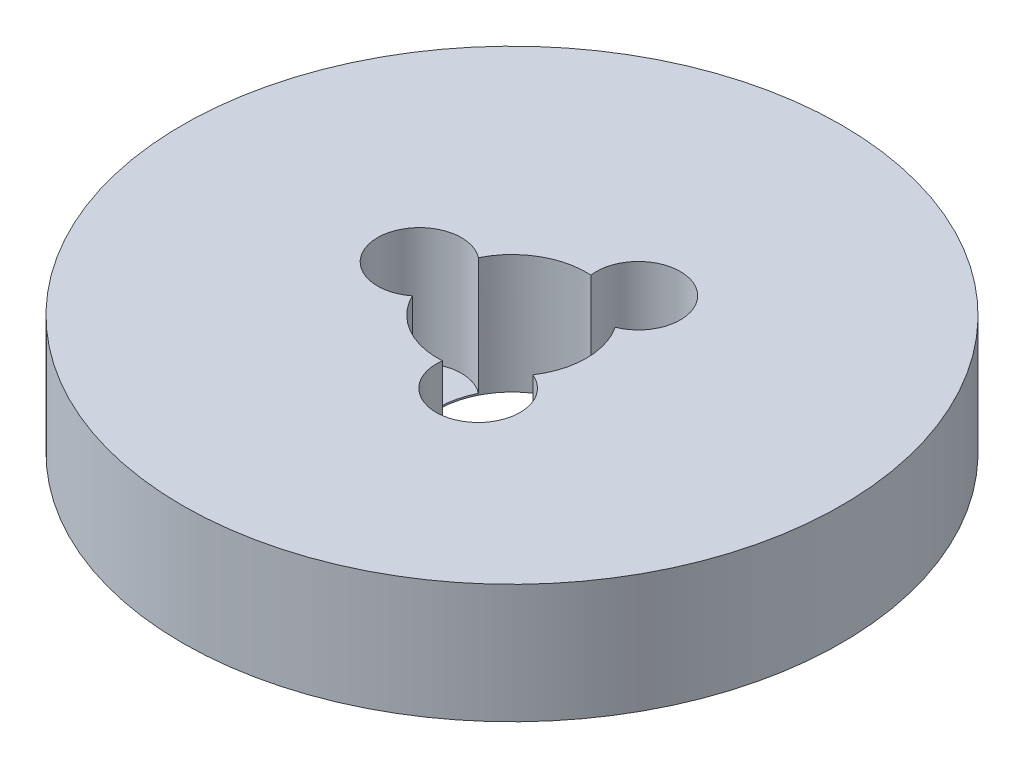
ISO-10303-21;
HEADER;
FILE_DESCRIPTION(('STEP AP214'),'2;1');
FILE_NAME('part.step','',(''),(''),'','','');
FILE_SCHEMA(('AUTOMOTIVE_DESIGN { 1 0 10303 214 1 1 1 1 }'));
ENDSEC;
DATA;
#1=APPLICATION_CONTEXT('core data for automotive mechanical design processes');
#2=APPLICATION_PROTOCOL_DEFINITION('international standard','automotive_design',2000,#1);
#3=PRODUCT_CONTEXT('',#1,'mechanical');
#4=PRODUCT('Part','Part','',(#3));
#5=PRODUCT_RELATED_PRODUCT_CATEGORY('part','',(#4));
#6=PRODUCT_DEFINITION_FORMATION('','',#4);
#7=PRODUCT_DEFINITION_CONTEXT('part definition',#1,'design');
#8=PRODUCT_DEFINITION('design','',#6,#7);
#9=PRODUCT_DEFINITION_SHAPE('','',#8);
#10=(LENGTH_UNIT() NAMED_UNIT(*) SI_UNIT(.MILLI.,.METRE.));
#11=(NAMED_UNIT(*) PLANE_ANGLE_UNIT() SI_UNIT($,.RADIAN.));
#12=(NAMED_UNIT(*) SI_UNIT($,.STERADIAN.) SOLID_ANGLE_UNIT());
#13=UNCERTAINTY_MEASURE_WITH_UNIT(LENGTH_MEASURE(1.E-05),#10,'distance_accuracy_value','');
#14=(GEOMETRIC_REPRESENTATION_CONTEXT(3) GLOBAL_UNCERTAINTY_ASSIGNED_CONTEXT((#13)) GLOBAL_UNIT_ASSIGNED_CONTEXT((#10,
#11,#12)) REPRESENTATION_CONTEXT('',''));
#15=CARTESIAN_POINT('',(0.,0.,0.));
#16=DIRECTION('',(0.,0.,1.));
#17=DIRECTION('',(1.,0.,0.));
#18=AXIS2_PLACEMENT_3D('',#15,#16,#17);
#19=CARTESIAN_POINT('',(0.,28.,0.));
#20=DIRECTION('',(0.,-1.,0.));
#21=DIRECTION('',(0.,0.,-1.));
#22=AXIS2_PLACEMENT_3D('',#19,#20,#21);
#23=CYLINDRICAL_SURFACE('',#22,77.5);
#24=CARTESIAN_POINT('',(0.,28.,0.));
#25=DIRECTION('',(0.,1.,0.));
#26=DIRECTION('',(0.,0.,1.));
#27=AXIS2_PLACEMENT_3D('',#24,#25,#26);
#28=CIRCLE('',#27,77.5);
#29=CARTESIAN_POINT('',(0.,28.,77.5));
#30=VERTEX_POINT('',#29);
#31=EDGE_CURVE('E126',#30,#30,#28,.T.);
#32=ORIENTED_EDGE('',*,*,#31,.F.);
#33=EDGE_LOOP('',(#32));
#34=FACE_BOUND('',#33,.T.);
#35=CARTESIAN_POINT('',(0.,0.,0.));
#36=DIRECTION('',(0.,1.,0.));
#37=DIRECTION('',(0.,0.,1.));
#38=AXIS2_PLACEMENT_3D('',#35,#36,#37);
#39=CIRCLE('',#38,77.5);
#40=CARTESIAN_POINT('',(0.,0.,77.5));
#41=VERTEX_POINT('',#40);
#42=EDGE_CURVE('E124',#41,#41,#39,.T.);
#43=ORIENTED_EDGE('',*,*,#42,.T.);
#44=EDGE_LOOP('',(#43));
#45=FACE_BOUND('',#44,.T.);
#46=ADVANCED_FACE('F39',(#34,#45),#23,.T.);
#47=CARTESIAN_POINT('',(0.,28.,0.));
#48=DIRECTION('',(0.,1.,0.));
#49=DIRECTION('',(0.,0.,1.));
#50=AXIS2_PLACEMENT_3D('',#47,#48,#49);
#51=PLANE('',#50);
#52=CARTESIAN_POINT('',(10.8769320128136,28.,18.8393988766654));
#53=DIRECTION('',(0.,1.,0.));
#54=DIRECTION('',(0.866025403784436,0.,-0.500000000000004));
#55=AXIS2_PLACEMENT_3D('',#52,#53,#54);
#56=CIRCLE('',#55,9.87124571682033);
#57=CARTESIAN_POINT('',(1.10179556648038,28.,17.4652811752254));
#58=VERTEX_POINT('',#57);
#59=CARTESIAN_POINT('',(14.5744793987433,28.,9.68682353796166));
#60=VERTEX_POINT('',#59);
#61=EDGE_CURVE('E147',#58,#60,#56,.T.);
#62=ORIENTED_EDGE('',*,*,#61,.F.);
#63=CARTESIAN_POINT('',(0.,28.,0.));
#64=DIRECTION('',(0.,1.,0.));
#65=DIRECTION('',(0.,0.,1.));
#66=AXIS2_PLACEMENT_3D('',#63,#64,#65);
#67=CIRCLE('',#66,17.5);
#68=CARTESIAN_POINT('',(-15.6762749652235,28.,7.77845763726372));
#69=VERTEX_POINT('',#68);
#70=EDGE_CURVE('E118',#69,#58,#67,.T.);
#71=ORIENTED_EDGE('',*,*,#70,.F.);
#72=CARTESIAN_POINT('',(-21.7538640256271,28.,0.));
#73=DIRECTION('',(0.,1.,0.));
#74=DIRECTION('',(0.,0.,1.));
#75=AXIS2_PLACEMENT_3D('',#72,#73,#74);
#76=CIRCLE('',#75,9.87124571682033);
#77=CARTESIAN_POINT('',(-15.6762749652235,28.,-7.77845763726372));
#78=VERTEX_POINT('',#77);
#79=EDGE_CURVE('E113',#78,#69,#76,.T.);
#80=ORIENTED_EDGE('',*,*,#79,.F.);
#81=CARTESIAN_POINT('',(1.10179556648013,28.,-17.4652811752255));
#82=VERTEX_POINT('',#81);
#83=EDGE_CURVE('E106',#82,#78,#67,.T.);
#84=ORIENTED_EDGE('',*,*,#83,.F.);
#85=CARTESIAN_POINT('',(10.8769320128134,28.,-18.8393988766656));
#86=DIRECTION('',(0.,1.,0.));
#87=DIRECTION('',(-0.866025403784443,0.,-0.499999999999992));
#88=AXIS2_PLACEMENT_3D('',#85,#86,#87);
#89=CIRCLE('',#88,9.87124571682033);
#90=CARTESIAN_POINT('',(14.5744793987431,28.,-9.68682353796186));
#91=VERTEX_POINT('',#90);
#92=EDGE_CURVE('E90',#91,#82,#89,.T.);
#93=ORIENTED_EDGE('',*,*,#92,.F.);
#94=EDGE_CURVE('E116',#60,#91,#67,.T.);
#95=ORIENTED_EDGE('',*,*,#94,.F.);
#96=EDGE_LOOP('',(#62,#71,#80,#84,#93,#95));
#97=FACE_BOUND('',#96,.T.);
#98=ORIENTED_EDGE('',*,*,#31,.T.);
#99=EDGE_LOOP('',(#98));
#100=FACE_BOUND('',#99,.T.);
#101=ADVANCED_FACE('F115',(#97,#100),#51,.T.);
#102=CARTESIAN_POINT('',(0.,0.,0.));
#103=DIRECTION('',(0.,1.,0.));
#104=DIRECTION('',(0.,0.,1.));
#105=AXIS2_PLACEMENT_3D('',#102,#103,#104);
#106=PLANE('',#105);
#107=CARTESIAN_POINT('',(0.,0.,0.));
#108=DIRECTION('',(0.,1.,0.));
#109=DIRECTION('',(0.,0.,1.));
#110=AXIS2_PLACEMENT_3D('',#107,#108,#109);
#111=CIRCLE('',#110,17.5);
#112=CARTESIAN_POINT('',(0.,0.,17.5));
#113=VERTEX_POINT('',#112);
#114=EDGE_CURVE('E120',#113,#113,#111,.T.);
#115=ORIENTED_EDGE('',*,*,#114,.T.);
#116=EDGE_LOOP('',(#115));
#117=FACE_BOUND('',#116,.T.);
#118=ORIENTED_EDGE('',*,*,#42,.F.);
#119=EDGE_LOOP('',(#118));
#120=FACE_BOUND('',#119,.T.);
#121=ADVANCED_FACE('F164',(#117,#120),#106,.F.);
#122=CARTESIAN_POINT('',(0.,28.,0.));
#123=DIRECTION('',(0.,-1.,0.));
#124=DIRECTION('',(0.,0.,-1.));
#125=AXIS2_PLACEMENT_3D('',#122,#123,#124);
#126=CYLINDRICAL_SURFACE('',#125,17.5);
#127=DIRECTION('',(0.,1.,0.));
#128=VECTOR('',#127,1.);
#129=CARTESIAN_POINT('',(1.10179556648038,14.186914892318,17.4652811752254));
#130=LINE('',#129,#128);
#131=CARTESIAN_POINT('',(1.10179556648038,0.373829784635925,17.4652811752254));
#132=VERTEX_POINT('',#131);
#133=EDGE_CURVE('E11',#132,#58,#130,.T.);
#134=ORIENTED_EDGE('',*,*,#133,.F.);
#135=CARTESIAN_POINT('',(0.,0.373829784635925,0.));
#136=DIRECTION('',(0.,1.,0.));
#137=DIRECTION('',(0.,0.,1.));
#138=AXIS2_PLACEMENT_3D('',#135,#136,#137);
#139=CIRCLE('',#138,17.5);
#140=CARTESIAN_POINT('',(14.5744793987433,0.373829784635925,9.68682353796166));
#141=VERTEX_POINT('',#140);
#142=EDGE_CURVE('E144',#132,#141,#139,.T.);
#143=ORIENTED_EDGE('',*,*,#142,.T.);
#144=DIRECTION('',(0.,1.,0.));
#145=VECTOR('',#144,1.);
#146=CARTESIAN_POINT('',(14.5744793987433,14.186914892318,9.68682353796166));
#147=LINE('',#146,#145);
#148=EDGE_CURVE('E46',#60,#141,#147,.F.);
#149=ORIENTED_EDGE('',*,*,#148,.F.);
#150=ORIENTED_EDGE('',*,*,#94,.T.);
#151=DIRECTION('',(0.,1.,0.));
#152=VECTOR('',#151,1.);
#153=CARTESIAN_POINT('',(14.5744793987431,14.186914892318,-9.68682353796186));
#154=LINE('',#153,#152);
#155=CARTESIAN_POINT('',(14.5744793987431,0.373829784635925,-9.68682353796186));
#156=VERTEX_POINT('',#155);
#157=EDGE_CURVE('E92',#156,#91,#154,.T.);
#158=ORIENTED_EDGE('',*,*,#157,.F.);
#159=CARTESIAN_POINT('',(0.,0.373829784635925,0.));
#160=DIRECTION('',(0.,1.,0.));
#161=DIRECTION('',(0.,0.,1.));
#162=AXIS2_PLACEMENT_3D('',#159,#160,#161);
#163=CIRCLE('',#162,17.5);
#164=CARTESIAN_POINT('',(1.10179556648013,0.373829784635925,-17.4652811752255));
#165=VERTEX_POINT('',#164);
#166=EDGE_CURVE('E107',#156,#165,#163,.T.);
#167=ORIENTED_EDGE('',*,*,#166,.T.);
#168=DIRECTION('',(0.,1.,0.));
#169=VECTOR('',#168,1.);
#170=CARTESIAN_POINT('',(1.10179556648013,14.186914892318,-17.4652811752255));
#171=LINE('',#170,#169);
#172=EDGE_CURVE('E95',#82,#165,#171,.F.);
#173=ORIENTED_EDGE('',*,*,#172,.F.);
#174=ORIENTED_EDGE('',*,*,#83,.T.);
#175=DIRECTION('',(0.,1.,0.));
#176=VECTOR('',#175,1.);
#177=CARTESIAN_POINT('',(-15.6762749652235,14.186914892318,-7.77845763726372));
#178=LINE('',#177,#176);
#179=CARTESIAN_POINT('',(-15.6762749652235,0.373829784635925,-7.77845763726372));
#180=VERTEX_POINT('',#179);
#181=EDGE_CURVE('E143',#180,#78,#178,.T.);
#182=ORIENTED_EDGE('',*,*,#181,.F.);
#183=CARTESIAN_POINT('',(0.,0.373829784635925,0.));
#184=DIRECTION('',(0.,1.,0.));
#185=DIRECTION('',(0.,0.,1.));
#186=AXIS2_PLACEMENT_3D('',#183,#184,#185);
#187=CIRCLE('',#186,17.5);
#188=CARTESIAN_POINT('',(-15.6762749652235,0.373829784635925,7.77845763726372));
#189=VERTEX_POINT('',#188);
#190=EDGE_CURVE('E132',#180,#189,#187,.T.);
#191=ORIENTED_EDGE('',*,*,#190,.T.);
#192=DIRECTION('',(0.,1.,0.));
#193=VECTOR('',#192,1.);
#194=CARTESIAN_POINT('',(-15.6762749652235,14.186914892318,7.77845763726372));
#195=LINE('',#194,#193);
#196=EDGE_CURVE('E137',#69,#189,#195,.F.);
#197=ORIENTED_EDGE('',*,*,#196,.F.);
#198=ORIENTED_EDGE('',*,*,#70,.T.);
#199=EDGE_LOOP('',(#134,#143,#149,#150,#158,#167,#173,#174,#182,#191,#197,#198));
#200=FACE_BOUND('',#199,.T.);
#201=ORIENTED_EDGE('',*,*,#114,.F.);
#202=EDGE_LOOP('',(#201));
#203=FACE_BOUND('',#202,.T.);
#204=ADVANCED_FACE('F103',(#200,#203),#126,.F.);
#205=CARTESIAN_POINT('',(-21.7538640256271,0.373829784635925,0.));
#206=DIRECTION('',(0.,1.,0.));
#207=DIRECTION('',(0.,0.,1.));
#208=AXIS2_PLACEMENT_3D('',#205,#206,#207);
#209=CYLINDRICAL_SURFACE('',#208,9.87124571682033);
#210=ORIENTED_EDGE('',*,*,#181,.T.);
#211=ORIENTED_EDGE('',*,*,#79,.T.);
#212=ORIENTED_EDGE('',*,*,#196,.T.);
#213=CARTESIAN_POINT('',(-21.7538640256271,0.373829784635925,0.));
#214=DIRECTION('',(0.,1.,0.));
#215=DIRECTION('',(0.,0.,1.));
#216=AXIS2_PLACEMENT_3D('',#213,#214,#215);
#217=CIRCLE('',#216,9.87124571682033);
#218=EDGE_CURVE('E121',#180,#189,#217,.T.);
#219=ORIENTED_EDGE('',*,*,#218,.F.);
#220=EDGE_LOOP('',(#210,#211,#212,#219));
#221=FACE_BOUND('',#220,.T.);
#222=ADVANCED_FACE('F174',(#221),#209,.F.);
#223=CARTESIAN_POINT('',(-21.7538640256271,0.373829784635925,0.));
#224=DIRECTION('',(0.,1.,0.));
#225=DIRECTION('',(0.,0.,1.));
#226=AXIS2_PLACEMENT_3D('',#223,#224,#225);
#227=PLANE('',#226);
#228=ORIENTED_EDGE('',*,*,#218,.T.);
#229=ORIENTED_EDGE('',*,*,#190,.F.);
#230=EDGE_LOOP('',(#228,#229));
#231=FACE_BOUND('',#230,.T.);
#232=ADVANCED_FACE('F177',(#231),#227,.T.);
#233=CARTESIAN_POINT('',(10.8769320128134,0.373829784635925,-18.8393988766656));
#234=DIRECTION('',(0.,1.,0.));
#235=DIRECTION('',(0.,0.,1.));
#236=AXIS2_PLACEMENT_3D('',#233,#234,#235);
#237=CYLINDRICAL_SURFACE('',#236,9.87124571682033);
#238=ORIENTED_EDGE('',*,*,#157,.T.);
#239=ORIENTED_EDGE('',*,*,#92,.T.);
#240=ORIENTED_EDGE('',*,*,#172,.T.);
#241=CARTESIAN_POINT('',(10.8769320128134,0.373829784635925,-18.8393988766656));
#242=DIRECTION('',(0.,1.,0.));
#243=DIRECTION('',(-0.866025403784443,0.,-0.499999999999992));
#244=AXIS2_PLACEMENT_3D('',#241,#242,#243);
#245=CIRCLE('',#244,9.87124571682033);
#246=EDGE_CURVE('E56',#156,#165,#245,.T.);
#247=ORIENTED_EDGE('',*,*,#246,.F.);
#248=EDGE_LOOP('',(#238,#239,#240,#247));
#249=FACE_BOUND('',#248,.T.);
#250=ADVANCED_FACE('F93',(#249),#237,.F.);
#251=CARTESIAN_POINT('',(10.8769320128134,0.373829784635925,-18.8393988766656));
#252=DIRECTION('',(0.,1.,0.));
#253=DIRECTION('',(-0.866025403784443,0.,-0.499999999999992));
#254=AXIS2_PLACEMENT_3D('',#251,#252,#253);
#255=PLANE('',#254);
#256=ORIENTED_EDGE('',*,*,#246,.T.);
#257=ORIENTED_EDGE('',*,*,#166,.F.);
#258=EDGE_LOOP('',(#256,#257));
#259=FACE_BOUND('',#258,.T.);
#260=ADVANCED_FACE('F160',(#259),#255,.T.);
#261=CARTESIAN_POINT('',(10.8769320128136,0.373829784635925,18.8393988766654));
#262=DIRECTION('',(0.,1.,0.));
#263=DIRECTION('',(0.,0.,1.));
#264=AXIS2_PLACEMENT_3D('',#261,#262,#263);
#265=CYLINDRICAL_SURFACE('',#264,9.87124571682033);
#266=ORIENTED_EDGE('',*,*,#133,.T.);
#267=ORIENTED_EDGE('',*,*,#61,.T.);
#268=ORIENTED_EDGE('',*,*,#148,.T.);
#269=CARTESIAN_POINT('',(10.8769320128136,0.373829784635925,18.8393988766654));
#270=DIRECTION('',(0.,1.,0.));
#271=DIRECTION('',(0.866025403784436,0.,-0.500000000000004));
#272=AXIS2_PLACEMENT_3D('',#269,#270,#271);
#273=CIRCLE('',#272,9.87124571682033);
#274=EDGE_CURVE('E55',#132,#141,#273,.T.);
#275=ORIENTED_EDGE('',*,*,#274,.F.);
#276=EDGE_LOOP('',(#266,#267,#268,#275));
#277=FACE_BOUND('',#276,.T.);
#278=ADVANCED_FACE('F149',(#277),#265,.F.);
#279=CARTESIAN_POINT('',(10.8769320128136,0.373829784635925,18.8393988766654));
#280=DIRECTION('',(0.,1.,0.));
#281=DIRECTION('',(0.866025403784436,0.,-0.500000000000004));
#282=AXIS2_PLACEMENT_3D('',#279,#280,#281);
#283=PLANE('',#282);
#284=ORIENTED_EDGE('',*,*,#274,.T.);
#285=ORIENTED_EDGE('',*,*,#142,.F.);
#286=EDGE_LOOP('',(#284,#285));
#287=FACE_BOUND('',#286,.T.);
#288=ADVANCED_FACE('F151',(#287),#283,.T.);
#289=CLOSED_SHELL('',(#46,#101,#121,#204,#222,#232,#250,#260,#278,#288));
#290=MANIFOLD_SOLID_BREP('B2',#289);
#291=ADVANCED_BREP_SHAPE_REPRESENTATION('',(#18,#290),#14);
#292=SHAPE_DEFINITION_REPRESENTATION(#9,#291);
ENDSEC;
END-ISO-10303-21;
